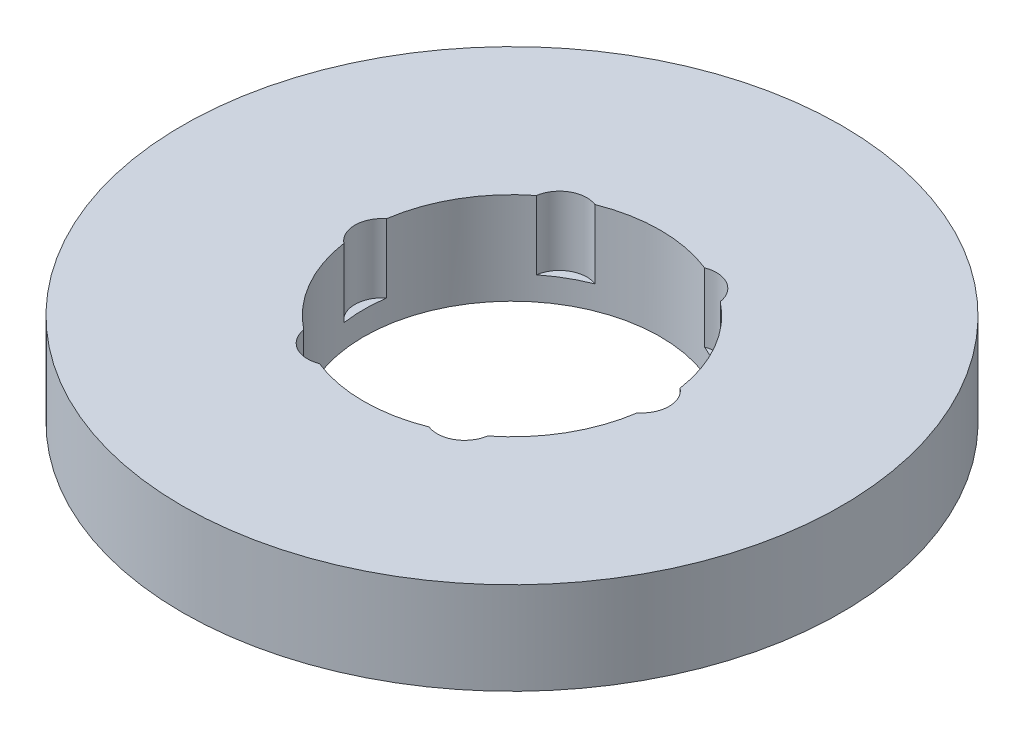
ISO-10303-21;
HEADER;
FILE_DESCRIPTION(('STEP AP214'),'2;1');
FILE_NAME('part.step','',(''),(''),'','','');
FILE_SCHEMA(('AUTOMOTIVE_DESIGN { 1 0 10303 214 1 1 1 1 }'));
ENDSEC;
DATA;
#1=APPLICATION_CONTEXT('core data for automotive mechanical design processes');
#2=APPLICATION_PROTOCOL_DEFINITION('international standard','automotive_design',2000,#1);
#3=PRODUCT_CONTEXT('',#1,'mechanical');
#4=PRODUCT('Part','Part','',(#3));
#5=PRODUCT_RELATED_PRODUCT_CATEGORY('part','',(#4));
#6=PRODUCT_DEFINITION_FORMATION('','',#4);
#7=PRODUCT_DEFINITION_CONTEXT('part definition',#1,'design');
#8=PRODUCT_DEFINITION('design','',#6,#7);
#9=PRODUCT_DEFINITION_SHAPE('','',#8);
#10=(LENGTH_UNIT() NAMED_UNIT(*) SI_UNIT(.MILLI.,.METRE.));
#11=(NAMED_UNIT(*) PLANE_ANGLE_UNIT() SI_UNIT($,.RADIAN.));
#12=(NAMED_UNIT(*) SI_UNIT($,.STERADIAN.) SOLID_ANGLE_UNIT());
#13=UNCERTAINTY_MEASURE_WITH_UNIT(LENGTH_MEASURE(1.E-05),#10,'distance_accuracy_value','');
#14=(GEOMETRIC_REPRESENTATION_CONTEXT(3) GLOBAL_UNCERTAINTY_ASSIGNED_CONTEXT((#13)) GLOBAL_UNIT_ASSIGNED_CONTEXT((#10,
#11,#12)) REPRESENTATION_CONTEXT('',''));
#15=CARTESIAN_POINT('',(0.,0.,0.));
#16=DIRECTION('',(0.,0.,1.));
#17=DIRECTION('',(1.,0.,0.));
#18=AXIS2_PLACEMENT_3D('',#15,#16,#17);
#19=CARTESIAN_POINT('',(0.,28.,0.));
#20=DIRECTION('',(0.,-1.,0.));
#21=DIRECTION('',(0.,0.,-1.));
#22=AXIS2_PLACEMENT_3D('',#19,#20,#21);
#23=CYLINDRICAL_SURFACE('',#22,100.);
#24=CARTESIAN_POINT('',(0.,28.,0.));
#25=DIRECTION('',(0.,1.,0.));
#26=DIRECTION('',(0.,0.,1.));
#27=AXIS2_PLACEMENT_3D('',#24,#25,#26);
#28=CIRCLE('',#27,100.);
#29=CARTESIAN_POINT('',(0.,28.,100.));
#30=VERTEX_POINT('',#29);
#31=EDGE_CURVE('E162',#30,#30,#28,.T.);
#32=ORIENTED_EDGE('',*,*,#31,.F.);
#33=EDGE_LOOP('',(#32));
#34=FACE_BOUND('',#33,.T.);
#35=CARTESIAN_POINT('',(0.,0.,0.));
#36=DIRECTION('',(0.,1.,0.));
#37=DIRECTION('',(0.,0.,1.));
#38=AXIS2_PLACEMENT_3D('',#35,#36,#37);
#39=CIRCLE('',#38,100.);
#40=CARTESIAN_POINT('',(0.,0.,100.));
#41=VERTEX_POINT('',#40);
#42=EDGE_CURVE('E157',#41,#41,#39,.T.);
#43=ORIENTED_EDGE('',*,*,#42,.T.);
#44=EDGE_LOOP('',(#43));
#45=FACE_BOUND('',#44,.T.);
#46=ADVANCED_FACE('F39',(#34,#45),#23,.T.);
#47=CARTESIAN_POINT('',(0.,28.,0.));
#48=DIRECTION('',(0.,1.,0.));
#49=DIRECTION('',(0.,0.,1.));
#50=AXIS2_PLACEMENT_3D('',#47,#48,#49);
#51=PLANE('',#50);
#52=CARTESIAN_POINT('',(-19.6706250127631,28.,-34.07052193874));
#53=DIRECTION('',(0.,1.,0.));
#54=DIRECTION('',(-0.866025403784433,0.,0.50000000000001));
#55=AXIS2_PLACEMENT_3D('',#52,#53,#54);
#56=CIRCLE('',#55,8.31045422422269);
#57=CARTESIAN_POINT('',(-16.6422020313438,28.,-41.8095337399012));
#58=VERTEX_POINT('',#57);
#59=CARTESIAN_POINT('',(-27.887017323466,28.,-35.3173366040067));
#60=VERTEX_POINT('',#59);
#61=EDGE_CURVE('E218',#58,#60,#56,.T.);
#62=ORIENTED_EDGE('',*,*,#61,.F.);
#63=CARTESIAN_POINT('',(0.,28.,0.));
#64=DIRECTION('',(0.,1.,0.));
#65=DIRECTION('',(0.,0.,1.));
#66=AXIS2_PLACEMENT_3D('',#63,#64,#65);
#67=CIRCLE('',#66,45.);
#68=CARTESIAN_POINT('',(16.6422020313429,28.,-41.8095337399015));
#69=VERTEX_POINT('',#68);
#70=EDGE_CURVE('E169',#69,#58,#67,.T.);
#71=ORIENTED_EDGE('',*,*,#70,.F.);
#72=CARTESIAN_POINT('',(19.6706250127624,28.,-34.0705219387404));
#73=DIRECTION('',(0.,1.,0.));
#74=DIRECTION('',(-0.866025403784443,0.,-0.499999999999992));
#75=AXIS2_PLACEMENT_3D('',#72,#73,#74);
#76=CIRCLE('',#75,8.31045422422269);
#77=CARTESIAN_POINT('',(27.8870173234652,28.,-35.3173366040073));
#78=VERTEX_POINT('',#77);
#79=EDGE_CURVE('E285',#78,#69,#76,.T.);
#80=ORIENTED_EDGE('',*,*,#79,.F.);
#81=CARTESIAN_POINT('',(44.5292193548089,28.,-6.49219713589438));
#82=VERTEX_POINT('',#81);
#83=EDGE_CURVE('E174',#82,#78,#67,.T.);
#84=ORIENTED_EDGE('',*,*,#83,.F.);
#85=CARTESIAN_POINT('',(39.3412500255254,28.,0.));
#86=DIRECTION('',(0.,1.,0.));
#87=DIRECTION('',(0.,0.,-1.));
#88=AXIS2_PLACEMENT_3D('',#85,#86,#87);
#89=CIRCLE('',#88,8.31045422422269);
#90=CARTESIAN_POINT('',(44.5292193548089,28.,6.49219713589438));
#91=VERTEX_POINT('',#90);
#92=EDGE_CURVE('E280',#91,#82,#89,.T.);
#93=ORIENTED_EDGE('',*,*,#92,.F.);
#94=CARTESIAN_POINT('',(27.8870173234657,28.,35.3173366040069));
#95=VERTEX_POINT('',#94);
#96=EDGE_CURVE('E164',#95,#91,#67,.T.);
#97=ORIENTED_EDGE('',*,*,#96,.F.);
#98=CARTESIAN_POINT('',(19.6706250127629,28.,34.0705219387401));
#99=DIRECTION('',(0.,1.,0.));
#100=DIRECTION('',(0.866025403784436,0.,-0.500000000000004));
#101=AXIS2_PLACEMENT_3D('',#98,#99,#100);
#102=CIRCLE('',#101,8.31045422422269);
#103=CARTESIAN_POINT('',(16.6422020313435,28.,41.8095337399013));
#104=VERTEX_POINT('',#103);
#105=EDGE_CURVE('E269',#104,#95,#102,.T.);
#106=ORIENTED_EDGE('',*,*,#105,.F.);
#107=CARTESIAN_POINT('',(-16.6422020313432,28.,41.8095337399014));
#108=VERTEX_POINT('',#107);
#109=EDGE_CURVE('E149',#108,#104,#67,.T.);
#110=ORIENTED_EDGE('',*,*,#109,.F.);
#111=CARTESIAN_POINT('',(-19.6706250127626,28.,34.0705219387403));
#112=DIRECTION('',(0.,1.,0.));
#113=DIRECTION('',(0.86602540378444,0.,0.499999999999998));
#114=AXIS2_PLACEMENT_3D('',#111,#112,#113);
#115=CIRCLE('',#114,8.31045422422269);
#116=CARTESIAN_POINT('',(-27.8870173234655,28.,35.3173366040071));
#117=VERTEX_POINT('',#116);
#118=EDGE_CURVE('E128',#117,#108,#115,.T.);
#119=ORIENTED_EDGE('',*,*,#118,.F.);
#120=CARTESIAN_POINT('',(-44.5292193548089,28.,6.49219713589438));
#121=VERTEX_POINT('',#120);
#122=EDGE_CURVE('E148',#121,#117,#67,.T.);
#123=ORIENTED_EDGE('',*,*,#122,.F.);
#124=CARTESIAN_POINT('',(-39.3412500255254,28.,0.));
#125=DIRECTION('',(0.,1.,0.));
#126=DIRECTION('',(0.,0.,1.));
#127=AXIS2_PLACEMENT_3D('',#124,#125,#126);
#128=CIRCLE('',#127,8.31045422422269);
#129=CARTESIAN_POINT('',(-44.5292193548089,28.,-6.49219713589438));
#130=VERTEX_POINT('',#129);
#131=EDGE_CURVE('E179',#130,#121,#128,.T.);
#132=ORIENTED_EDGE('',*,*,#131,.F.);
#133=EDGE_CURVE('E161',#60,#130,#67,.T.);
#134=ORIENTED_EDGE('',*,*,#133,.F.);
#135=EDGE_LOOP('',(#62,#71,#80,#84,#93,#97,#106,#110,#119,#123,#132,#134));
#136=FACE_BOUND('',#135,.T.);
#137=ORIENTED_EDGE('',*,*,#31,.T.);
#138=EDGE_LOOP('',(#137));
#139=FACE_BOUND('',#138,.T.);
#140=ADVANCED_FACE('F141',(#136,#139),#51,.T.);
#141=CARTESIAN_POINT('',(0.,0.,0.));
#142=DIRECTION('',(0.,1.,0.));
#143=DIRECTION('',(0.,0.,1.));
#144=AXIS2_PLACEMENT_3D('',#141,#142,#143);
#145=PLANE('',#144);
#146=CARTESIAN_POINT('',(0.,0.,0.));
#147=DIRECTION('',(0.,1.,0.));
#148=DIRECTION('',(0.,0.,1.));
#149=AXIS2_PLACEMENT_3D('',#146,#147,#148);
#150=CIRCLE('',#149,45.);
#151=CARTESIAN_POINT('',(0.,0.,45.));
#152=VERTEX_POINT('',#151);
#153=EDGE_CURVE('E166',#152,#152,#150,.T.);
#154=ORIENTED_EDGE('',*,*,#153,.T.);
#155=EDGE_LOOP('',(#154));
#156=FACE_BOUND('',#155,.T.);
#157=ORIENTED_EDGE('',*,*,#42,.F.);
#158=EDGE_LOOP('',(#157));
#159=FACE_BOUND('',#158,.T.);
#160=ADVANCED_FACE('F234',(#156,#159),#145,.F.);
#161=CARTESIAN_POINT('',(0.,28.,0.));
#162=DIRECTION('',(0.,-1.,0.));
#163=DIRECTION('',(0.,0.,-1.));
#164=AXIS2_PLACEMENT_3D('',#161,#162,#163);
#165=CYLINDRICAL_SURFACE('',#164,45.);
#166=DIRECTION('',(0.,1.,0.));
#167=VECTOR('',#166,1.);
#168=CARTESIAN_POINT('',(-16.6422020313438,17.5749174146203,-41.8095337399012));
#169=LINE('',#168,#167);
#170=CARTESIAN_POINT('',(-16.6422020313438,7.14983482924052,-41.8095337399012));
#171=VERTEX_POINT('',#170);
#172=EDGE_CURVE('E11',#171,#58,#169,.T.);
#173=ORIENTED_EDGE('',*,*,#172,.F.);
#174=CARTESIAN_POINT('',(0.,7.14983482924052,0.));
#175=DIRECTION('',(0.,1.,0.));
#176=DIRECTION('',(0.,0.,1.));
#177=AXIS2_PLACEMENT_3D('',#174,#175,#176);
#178=CIRCLE('',#177,45.);
#179=CARTESIAN_POINT('',(-27.887017323466,7.14983482924052,-35.3173366040067));
#180=VERTEX_POINT('',#179);
#181=EDGE_CURVE('E214',#171,#180,#178,.T.);
#182=ORIENTED_EDGE('',*,*,#181,.T.);
#183=DIRECTION('',(0.,1.,0.));
#184=VECTOR('',#183,1.);
#185=CARTESIAN_POINT('',(-27.887017323466,17.5749174146203,-35.3173366040067));
#186=LINE('',#185,#184);
#187=EDGE_CURVE('E46',#60,#180,#186,.F.);
#188=ORIENTED_EDGE('',*,*,#187,.F.);
#189=ORIENTED_EDGE('',*,*,#133,.T.);
#190=DIRECTION('',(0.,1.,0.));
#191=VECTOR('',#190,1.);
#192=CARTESIAN_POINT('',(-44.5292193548089,17.5749174146203,-6.49219713589438));
#193=LINE('',#192,#191);
#194=CARTESIAN_POINT('',(-44.5292193548089,7.14983482924052,-6.49219713589438));
#195=VERTEX_POINT('',#194);
#196=EDGE_CURVE('E187',#195,#130,#193,.T.);
#197=ORIENTED_EDGE('',*,*,#196,.F.);
#198=CARTESIAN_POINT('',(0.,7.14983482924052,0.));
#199=DIRECTION('',(0.,1.,0.));
#200=DIRECTION('',(0.,0.,1.));
#201=AXIS2_PLACEMENT_3D('',#198,#199,#200);
#202=CIRCLE('',#201,45.);
#203=CARTESIAN_POINT('',(-44.5292193548089,7.14983482924052,6.49219713589438));
#204=VERTEX_POINT('',#203);
#205=EDGE_CURVE('E184',#195,#204,#202,.T.);
#206=ORIENTED_EDGE('',*,*,#205,.T.);
#207=DIRECTION('',(0.,1.,0.));
#208=VECTOR('',#207,1.);
#209=CARTESIAN_POINT('',(-44.5292193548089,17.5749174146203,6.49219713589438));
#210=LINE('',#209,#208);
#211=EDGE_CURVE('E158',#121,#204,#210,.F.);
#212=ORIENTED_EDGE('',*,*,#211,.F.);
#213=ORIENTED_EDGE('',*,*,#122,.T.);
#214=DIRECTION('',(0.,1.,0.));
#215=VECTOR('',#214,1.);
#216=CARTESIAN_POINT('',(-27.8870173234655,17.5749174146203,35.3173366040071));
#217=LINE('',#216,#215);
#218=CARTESIAN_POINT('',(-27.8870173234655,7.14983482924052,35.3173366040071));
#219=VERTEX_POINT('',#218);
#220=EDGE_CURVE('E127',#219,#117,#217,.T.);
#221=ORIENTED_EDGE('',*,*,#220,.F.);
#222=CARTESIAN_POINT('',(0.,7.14983482924052,0.));
#223=DIRECTION('',(0.,1.,0.));
#224=DIRECTION('',(0.,0.,1.));
#225=AXIS2_PLACEMENT_3D('',#222,#223,#224);
#226=CIRCLE('',#225,45.);
#227=CARTESIAN_POINT('',(-16.6422020313432,7.14983482924052,41.8095337399014));
#228=VERTEX_POINT('',#227);
#229=EDGE_CURVE('E189',#219,#228,#226,.T.);
#230=ORIENTED_EDGE('',*,*,#229,.T.);
#231=DIRECTION('',(0.,1.,0.));
#232=VECTOR('',#231,1.);
#233=CARTESIAN_POINT('',(-16.6422020313432,17.5749174146203,41.8095337399014));
#234=LINE('',#233,#232);
#235=EDGE_CURVE('E140',#108,#228,#234,.F.);
#236=ORIENTED_EDGE('',*,*,#235,.F.);
#237=ORIENTED_EDGE('',*,*,#109,.T.);
#238=DIRECTION('',(0.,1.,0.));
#239=VECTOR('',#238,1.);
#240=CARTESIAN_POINT('',(16.6422020313435,17.5749174146203,41.8095337399013));
#241=LINE('',#240,#239);
#242=CARTESIAN_POINT('',(16.6422020313435,7.14983482924052,41.8095337399013));
#243=VERTEX_POINT('',#242);
#244=EDGE_CURVE('E196',#243,#104,#241,.T.);
#245=ORIENTED_EDGE('',*,*,#244,.F.);
#246=CARTESIAN_POINT('',(0.,7.14983482924052,0.));
#247=DIRECTION('',(0.,1.,0.));
#248=DIRECTION('',(0.,0.,1.));
#249=AXIS2_PLACEMENT_3D('',#246,#247,#248);
#250=CIRCLE('',#249,45.);
#251=CARTESIAN_POINT('',(27.8870173234657,7.14983482924052,35.3173366040069));
#252=VERTEX_POINT('',#251);
#253=EDGE_CURVE('E136',#243,#252,#250,.T.);
#254=ORIENTED_EDGE('',*,*,#253,.T.);
#255=DIRECTION('',(0.,1.,0.));
#256=VECTOR('',#255,1.);
#257=CARTESIAN_POINT('',(27.8870173234657,17.5749174146203,35.3173366040069));
#258=LINE('',#257,#256);
#259=EDGE_CURVE('E194',#95,#252,#258,.F.);
#260=ORIENTED_EDGE('',*,*,#259,.F.);
#261=ORIENTED_EDGE('',*,*,#96,.T.);
#262=DIRECTION('',(0.,1.,0.));
#263=VECTOR('',#262,1.);
#264=CARTESIAN_POINT('',(44.5292193548089,17.5749174146203,6.49219713589438));
#265=LINE('',#264,#263);
#266=CARTESIAN_POINT('',(44.5292193548089,7.14983482924052,6.49219713589438));
#267=VERTEX_POINT('',#266);
#268=EDGE_CURVE('E206',#267,#91,#265,.T.);
#269=ORIENTED_EDGE('',*,*,#268,.F.);
#270=CARTESIAN_POINT('',(0.,7.14983482924052,0.));
#271=DIRECTION('',(0.,1.,0.));
#272=DIRECTION('',(0.,0.,1.));
#273=AXIS2_PLACEMENT_3D('',#270,#271,#272);
#274=CIRCLE('',#273,45.);
#275=CARTESIAN_POINT('',(44.5292193548089,7.14983482924052,-6.49219713589438));
#276=VERTEX_POINT('',#275);
#277=EDGE_CURVE('E199',#267,#276,#274,.T.);
#278=ORIENTED_EDGE('',*,*,#277,.T.);
#279=DIRECTION('',(0.,1.,0.));
#280=VECTOR('',#279,1.);
#281=CARTESIAN_POINT('',(44.5292193548089,17.5749174146203,-6.49219713589438));
#282=LINE('',#281,#280);
#283=EDGE_CURVE('E201',#82,#276,#282,.F.);
#284=ORIENTED_EDGE('',*,*,#283,.F.);
#285=ORIENTED_EDGE('',*,*,#83,.T.);
#286=DIRECTION('',(0.,1.,0.));
#287=VECTOR('',#286,1.);
#288=CARTESIAN_POINT('',(27.8870173234652,17.5749174146203,-35.3173366040073));
#289=LINE('',#288,#287);
#290=CARTESIAN_POINT('',(27.8870173234652,7.14983482924052,-35.3173366040073));
#291=VERTEX_POINT('',#290);
#292=EDGE_CURVE('E213',#291,#78,#289,.T.);
#293=ORIENTED_EDGE('',*,*,#292,.F.);
#294=CARTESIAN_POINT('',(0.,7.14983482924052,0.));
#295=DIRECTION('',(0.,1.,0.));
#296=DIRECTION('',(0.,0.,1.));
#297=AXIS2_PLACEMENT_3D('',#294,#295,#296);
#298=CIRCLE('',#297,45.);
#299=CARTESIAN_POINT('',(16.6422020313429,7.14983482924052,-41.8095337399015));
#300=VERTEX_POINT('',#299);
#301=EDGE_CURVE('E208',#291,#300,#298,.T.);
#302=ORIENTED_EDGE('',*,*,#301,.T.);
#303=DIRECTION('',(0.,1.,0.));
#304=VECTOR('',#303,1.);
#305=CARTESIAN_POINT('',(16.6422020313429,17.5749174146203,-41.8095337399015));
#306=LINE('',#305,#304);
#307=EDGE_CURVE('E211',#69,#300,#306,.F.);
#308=ORIENTED_EDGE('',*,*,#307,.F.);
#309=ORIENTED_EDGE('',*,*,#70,.T.);
#310=EDGE_LOOP('',(#173,#182,#188,#189,#197,#206,#212,#213,#221,#230,#236,#237,#245,#254,#260,
#261,#269,#278,#284,#285,#293,#302,#308,#309));
#311=FACE_BOUND('',#310,.T.);
#312=ORIENTED_EDGE('',*,*,#153,.F.);
#313=EDGE_LOOP('',(#312));
#314=FACE_BOUND('',#313,.T.);
#315=ADVANCED_FACE('F152',(#311,#314),#165,.F.);
#316=CARTESIAN_POINT('',(-39.3412500255254,7.14983482924052,0.));
#317=DIRECTION('',(0.,1.,0.));
#318=DIRECTION('',(0.,0.,1.));
#319=AXIS2_PLACEMENT_3D('',#316,#317,#318);
#320=CYLINDRICAL_SURFACE('',#319,8.31045422422269);
#321=ORIENTED_EDGE('',*,*,#196,.T.);
#322=ORIENTED_EDGE('',*,*,#131,.T.);
#323=ORIENTED_EDGE('',*,*,#211,.T.);
#324=CARTESIAN_POINT('',(-39.3412500255254,7.14983482924052,0.));
#325=DIRECTION('',(0.,1.,0.));
#326=DIRECTION('',(0.,0.,1.));
#327=AXIS2_PLACEMENT_3D('',#324,#325,#326);
#328=CIRCLE('',#327,8.31045422422269);
#329=EDGE_CURVE('E180',#195,#204,#328,.T.);
#330=ORIENTED_EDGE('',*,*,#329,.F.);
#331=EDGE_LOOP('',(#321,#322,#323,#330));
#332=FACE_BOUND('',#331,.T.);
#333=ADVANCED_FACE('F244',(#332),#320,.F.);
#334=CARTESIAN_POINT('',(-39.3412500255254,7.14983482924052,0.));
#335=DIRECTION('',(0.,1.,0.));
#336=DIRECTION('',(0.,0.,1.));
#337=AXIS2_PLACEMENT_3D('',#334,#335,#336);
#338=PLANE('',#337);
#339=ORIENTED_EDGE('',*,*,#329,.T.);
#340=ORIENTED_EDGE('',*,*,#205,.F.);
#341=EDGE_LOOP('',(#339,#340));
#342=FACE_BOUND('',#341,.T.);
#343=ADVANCED_FACE('F248',(#342),#338,.T.);
#344=CARTESIAN_POINT('',(-19.6706250127626,7.14983482924052,34.0705219387403));
#345=DIRECTION('',(0.,1.,0.));
#346=DIRECTION('',(0.,0.,1.));
#347=AXIS2_PLACEMENT_3D('',#344,#345,#346);
#348=CYLINDRICAL_SURFACE('',#347,8.31045422422269);
#349=ORIENTED_EDGE('',*,*,#220,.T.);
#350=ORIENTED_EDGE('',*,*,#118,.T.);
#351=ORIENTED_EDGE('',*,*,#235,.T.);
#352=CARTESIAN_POINT('',(-19.6706250127626,7.14983482924052,34.0705219387403));
#353=DIRECTION('',(0.,1.,0.));
#354=DIRECTION('',(0.86602540378444,0.,0.499999999999998));
#355=AXIS2_PLACEMENT_3D('',#352,#353,#354);
#356=CIRCLE('',#355,8.31045422422269);
#357=EDGE_CURVE('E135',#219,#228,#356,.T.);
#358=ORIENTED_EDGE('',*,*,#357,.F.);
#359=EDGE_LOOP('',(#349,#350,#351,#358));
#360=FACE_BOUND('',#359,.T.);
#361=ADVANCED_FACE('F126',(#360),#348,.F.);
#362=CARTESIAN_POINT('',(-19.6706250127626,7.14983482924052,34.0705219387403));
#363=DIRECTION('',(0.,1.,0.));
#364=DIRECTION('',(0.86602540378444,0.,0.499999999999998));
#365=AXIS2_PLACEMENT_3D('',#362,#363,#364);
#366=PLANE('',#365);
#367=ORIENTED_EDGE('',*,*,#357,.T.);
#368=ORIENTED_EDGE('',*,*,#229,.F.);
#369=EDGE_LOOP('',(#367,#368));
#370=FACE_BOUND('',#369,.T.);
#371=ADVANCED_FACE('F258',(#370),#366,.T.);
#372=CARTESIAN_POINT('',(19.6706250127629,7.14983482924052,34.0705219387401));
#373=DIRECTION('',(0.,1.,0.));
#374=DIRECTION('',(0.,0.,1.));
#375=AXIS2_PLACEMENT_3D('',#372,#373,#374);
#376=CYLINDRICAL_SURFACE('',#375,8.31045422422269);
#377=ORIENTED_EDGE('',*,*,#244,.T.);
#378=ORIENTED_EDGE('',*,*,#105,.T.);
#379=ORIENTED_EDGE('',*,*,#259,.T.);
#380=CARTESIAN_POINT('',(19.6706250127629,7.14983482924052,34.0705219387401));
#381=DIRECTION('',(0.,1.,0.));
#382=DIRECTION('',(0.866025403784436,0.,-0.500000000000004));
#383=AXIS2_PLACEMENT_3D('',#380,#381,#382);
#384=CIRCLE('',#383,8.31045422422269);
#385=EDGE_CURVE('E147',#243,#252,#384,.T.);
#386=ORIENTED_EDGE('',*,*,#385,.F.);
#387=EDGE_LOOP('',(#377,#378,#379,#386));
#388=FACE_BOUND('',#387,.T.);
#389=ADVANCED_FACE('F256',(#388),#376,.F.);
#390=CARTESIAN_POINT('',(19.6706250127629,7.14983482924052,34.0705219387401));
#391=DIRECTION('',(0.,1.,0.));
#392=DIRECTION('',(0.866025403784436,0.,-0.500000000000004));
#393=AXIS2_PLACEMENT_3D('',#390,#391,#392);
#394=PLANE('',#393);
#395=ORIENTED_EDGE('',*,*,#385,.T.);
#396=ORIENTED_EDGE('',*,*,#253,.F.);
#397=EDGE_LOOP('',(#395,#396));
#398=FACE_BOUND('',#397,.T.);
#399=ADVANCED_FACE('F263',(#398),#394,.T.);
#400=CARTESIAN_POINT('',(39.3412500255254,7.14983482924052,0.));
#401=DIRECTION('',(0.,1.,0.));
#402=DIRECTION('',(0.,0.,1.));
#403=AXIS2_PLACEMENT_3D('',#400,#401,#402);
#404=CYLINDRICAL_SURFACE('',#403,8.31045422422269);
#405=ORIENTED_EDGE('',*,*,#268,.T.);
#406=ORIENTED_EDGE('',*,*,#92,.T.);
#407=ORIENTED_EDGE('',*,*,#283,.T.);
#408=CARTESIAN_POINT('',(39.3412500255254,7.14983482924052,0.));
#409=DIRECTION('',(0.,1.,0.));
#410=DIRECTION('',(0.,0.,-1.));
#411=AXIS2_PLACEMENT_3D('',#408,#409,#410);
#412=CIRCLE('',#411,8.31045422422269);
#413=EDGE_CURVE('E273',#267,#276,#412,.T.);
#414=ORIENTED_EDGE('',*,*,#413,.F.);
#415=EDGE_LOOP('',(#405,#406,#407,#414));
#416=FACE_BOUND('',#415,.T.);
#417=ADVANCED_FACE('F297',(#416),#404,.F.);
#418=CARTESIAN_POINT('',(39.3412500255254,7.14983482924052,0.));
#419=DIRECTION('',(0.,1.,0.));
#420=DIRECTION('',(0.,0.,-1.));
#421=AXIS2_PLACEMENT_3D('',#418,#419,#420);
#422=PLANE('',#421);
#423=ORIENTED_EDGE('',*,*,#413,.T.);
#424=ORIENTED_EDGE('',*,*,#277,.F.);
#425=EDGE_LOOP('',(#423,#424));
#426=FACE_BOUND('',#425,.T.);
#427=ADVANCED_FACE('F299',(#426),#422,.T.);
#428=CARTESIAN_POINT('',(19.6706250127624,7.14983482924052,-34.0705219387404));
#429=DIRECTION('',(0.,1.,0.));
#430=DIRECTION('',(0.,0.,1.));
#431=AXIS2_PLACEMENT_3D('',#428,#429,#430);
#432=CYLINDRICAL_SURFACE('',#431,8.31045422422269);
#433=ORIENTED_EDGE('',*,*,#292,.T.);
#434=ORIENTED_EDGE('',*,*,#79,.T.);
#435=ORIENTED_EDGE('',*,*,#307,.T.);
#436=CARTESIAN_POINT('',(19.6706250127624,7.14983482924052,-34.0705219387404));
#437=DIRECTION('',(0.,1.,0.));
#438=DIRECTION('',(-0.866025403784443,0.,-0.499999999999992));
#439=AXIS2_PLACEMENT_3D('',#436,#437,#438);
#440=CIRCLE('',#439,8.31045422422269);
#441=EDGE_CURVE('E56',#291,#300,#440,.T.);
#442=ORIENTED_EDGE('',*,*,#441,.F.);
#443=EDGE_LOOP('',(#433,#434,#435,#442));
#444=FACE_BOUND('',#443,.T.);
#445=ADVANCED_FACE('F292',(#444),#432,.F.);
#446=CARTESIAN_POINT('',(19.6706250127624,7.14983482924052,-34.0705219387404));
#447=DIRECTION('',(0.,1.,0.));
#448=DIRECTION('',(-0.866025403784443,0.,-0.499999999999992));
#449=AXIS2_PLACEMENT_3D('',#446,#447,#448);
#450=PLANE('',#449);
#451=ORIENTED_EDGE('',*,*,#441,.T.);
#452=ORIENTED_EDGE('',*,*,#301,.F.);
#453=EDGE_LOOP('',(#451,#452));
#454=FACE_BOUND('',#453,.T.);
#455=ADVANCED_FACE('F226',(#454),#450,.T.);
#456=CARTESIAN_POINT('',(-19.6706250127631,7.14983482924052,-34.07052193874));
#457=DIRECTION('',(0.,1.,0.));
#458=DIRECTION('',(0.,0.,1.));
#459=AXIS2_PLACEMENT_3D('',#456,#457,#458);
#460=CYLINDRICAL_SURFACE('',#459,8.31045422422269);
#461=ORIENTED_EDGE('',*,*,#172,.T.);
#462=ORIENTED_EDGE('',*,*,#61,.T.);
#463=ORIENTED_EDGE('',*,*,#187,.T.);
#464=CARTESIAN_POINT('',(-19.6706250127631,7.14983482924052,-34.07052193874));
#465=DIRECTION('',(0.,1.,0.));
#466=DIRECTION('',(-0.866025403784433,0.,0.50000000000001));
#467=AXIS2_PLACEMENT_3D('',#464,#465,#466);
#468=CIRCLE('',#467,8.31045422422269);
#469=EDGE_CURVE('E55',#171,#180,#468,.T.);
#470=ORIENTED_EDGE('',*,*,#469,.F.);
#471=EDGE_LOOP('',(#461,#462,#463,#470));
#472=FACE_BOUND('',#471,.T.);
#473=ADVANCED_FACE('F217',(#472),#460,.F.);
#474=CARTESIAN_POINT('',(-19.6706250127631,7.14983482924052,-34.07052193874));
#475=DIRECTION('',(0.,1.,0.));
#476=DIRECTION('',(-0.866025403784433,0.,0.50000000000001));
#477=AXIS2_PLACEMENT_3D('',#474,#475,#476);
#478=PLANE('',#477);
#479=ORIENTED_EDGE('',*,*,#469,.T.);
#480=ORIENTED_EDGE('',*,*,#181,.F.);
#481=EDGE_LOOP('',(#479,#480));
#482=FACE_BOUND('',#481,.T.);
#483=ADVANCED_FACE('F219',(#482),#478,.T.);
#484=CLOSED_SHELL('',(#46,#140,#160,#315,#333,#343,#361,#371,#389,#399,#417,#427,#445,#455,#473,#483));
#485=MANIFOLD_SOLID_BREP('B2',#484);
#486=ADVANCED_BREP_SHAPE_REPRESENTATION('',(#18,#485),#14);
#487=SHAPE_DEFINITION_REPRESENTATION(#9,#486);
ENDSEC;
END-ISO-10303-21;
